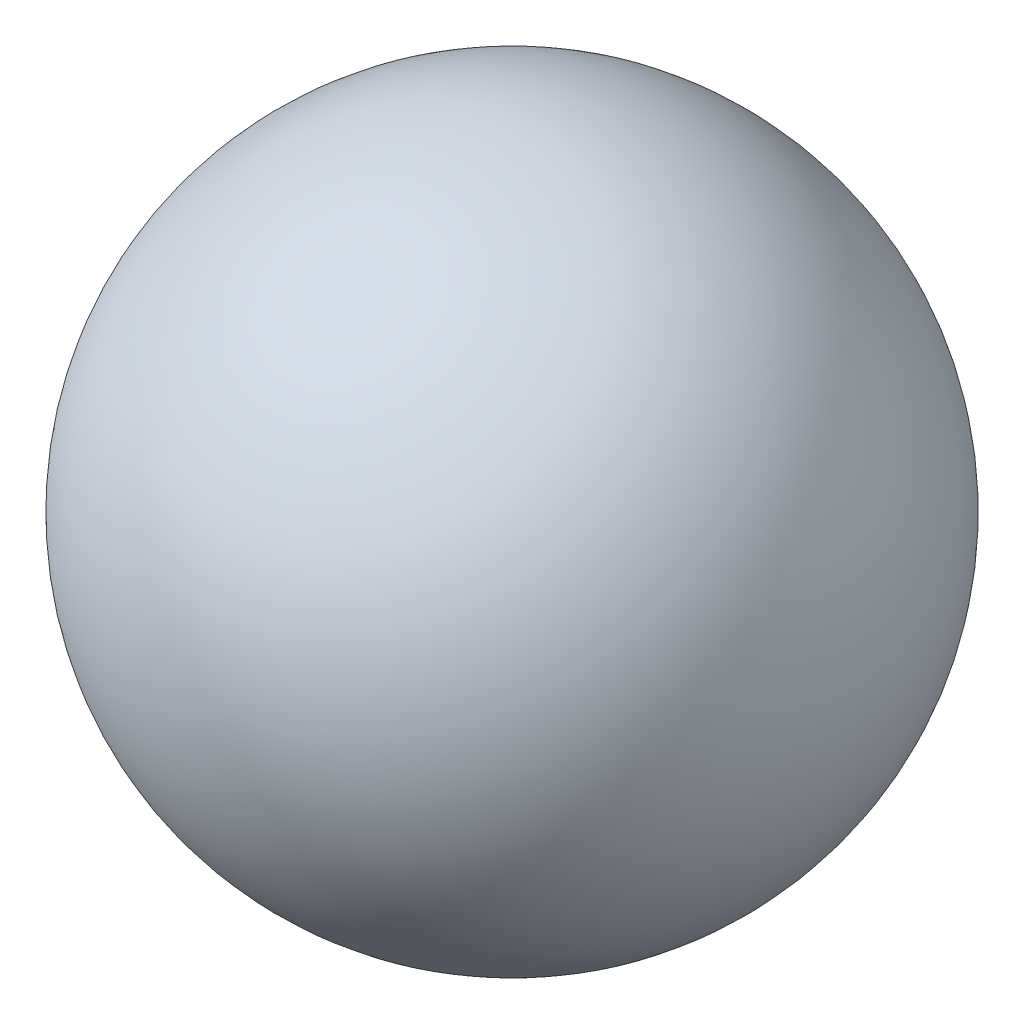
ISO-10303-21;
HEADER;
FILE_DESCRIPTION(('STEP AP214'),'2;1');
FILE_NAME('part.step','',(''),(''),'','','');
FILE_SCHEMA(('AUTOMOTIVE_DESIGN { 1 0 10303 214 1 1 1 1 }'));
ENDSEC;
DATA;
#1=APPLICATION_CONTEXT('core data for automotive mechanical design processes');
#2=APPLICATION_PROTOCOL_DEFINITION('international standard','automotive_design',2000,#1);
#3=PRODUCT_CONTEXT('',#1,'mechanical');
#4=PRODUCT('Part','Part','',(#3));
#5=PRODUCT_RELATED_PRODUCT_CATEGORY('part','',(#4));
#6=PRODUCT_DEFINITION_FORMATION('','',#4);
#7=PRODUCT_DEFINITION_CONTEXT('part definition',#1,'design');
#8=PRODUCT_DEFINITION('design','',#6,#7);
#9=PRODUCT_DEFINITION_SHAPE('','',#8);
#10=(LENGTH_UNIT() NAMED_UNIT(*) SI_UNIT(.MILLI.,.METRE.));
#11=(NAMED_UNIT(*) PLANE_ANGLE_UNIT() SI_UNIT($,.RADIAN.));
#12=(NAMED_UNIT(*) SI_UNIT($,.STERADIAN.) SOLID_ANGLE_UNIT());
#13=UNCERTAINTY_MEASURE_WITH_UNIT(LENGTH_MEASURE(1.E-05),#10,'distance_accuracy_value','');
#14=(GEOMETRIC_REPRESENTATION_CONTEXT(3) GLOBAL_UNCERTAINTY_ASSIGNED_CONTEXT((#13)) GLOBAL_UNIT_ASSIGNED_CONTEXT((#10,
#11,#12)) REPRESENTATION_CONTEXT('',''));
#15=CARTESIAN_POINT('',(0.,0.,0.));
#16=DIRECTION('',(0.,0.,1.));
#17=DIRECTION('',(1.,0.,0.));
#18=AXIS2_PLACEMENT_3D('',#15,#16,#17);
#19=CARTESIAN_POINT('',(0.,0.,0.));
#20=DIRECTION('',(0.,1.,0.));
#21=DIRECTION('',(1.,0.,0.));
#22=AXIS2_PLACEMENT_3D('',#19,#20,#21);
#23=SPHERICAL_SURFACE('',#22,2.3622);
#24=CARTESIAN_POINT('',(0.,2.3622,0.));
#25=VERTEX_POINT('',#24);
#26=VERTEX_LOOP('',#25);
#27=FACE_BOUND('',#26,.T.);
#28=ADVANCED_FACE('F33',(#27),#23,.T.);
#29=CLOSED_SHELL('',(#28));
#30=MANIFOLD_SOLID_BREP('B2',#29);
#31=ADVANCED_BREP_SHAPE_REPRESENTATION('',(#18,#30),#14);
#32=SHAPE_DEFINITION_REPRESENTATION(#9,#31);
ENDSEC;
END-ISO-10303-21;
